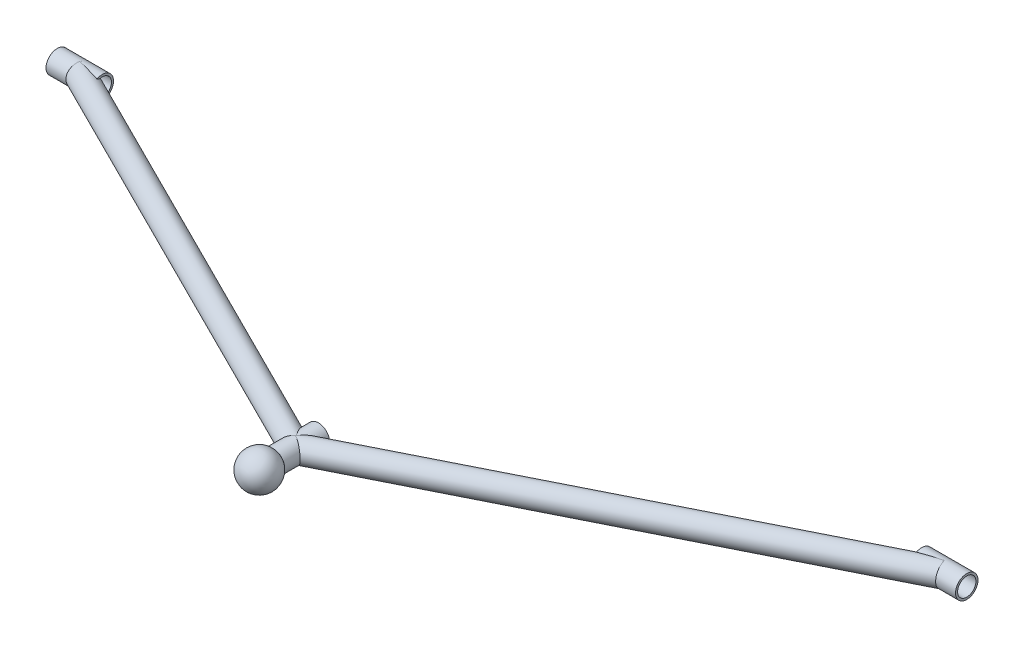
ISO-10303-21;
HEADER;
FILE_DESCRIPTION(('STEP AP214'),'2;1');
FILE_NAME('part.step','',(''),(''),'','','');
FILE_SCHEMA(('AUTOMOTIVE_DESIGN { 1 0 10303 214 1 1 1 1 }'));
ENDSEC;
DATA;
#1=APPLICATION_CONTEXT('core data for automotive mechanical design processes');
#2=APPLICATION_PROTOCOL_DEFINITION('international standard','automotive_design',2000,#1);
#3=PRODUCT_CONTEXT('',#1,'mechanical');
#4=PRODUCT('Part','Part','',(#3));
#5=PRODUCT_RELATED_PRODUCT_CATEGORY('part','',(#4));
#6=PRODUCT_DEFINITION_FORMATION('','',#4);
#7=PRODUCT_DEFINITION_CONTEXT('part definition',#1,'design');
#8=PRODUCT_DEFINITION('design','',#6,#7);
#9=PRODUCT_DEFINITION_SHAPE('','',#8);
#10=(LENGTH_UNIT() NAMED_UNIT(*) SI_UNIT(.MILLI.,.METRE.));
#11=(NAMED_UNIT(*) PLANE_ANGLE_UNIT() SI_UNIT($,.RADIAN.));
#12=(NAMED_UNIT(*) SI_UNIT($,.STERADIAN.) SOLID_ANGLE_UNIT());
#13=UNCERTAINTY_MEASURE_WITH_UNIT(LENGTH_MEASURE(1.E-05),#10,'distance_accuracy_value','');
#14=(GEOMETRIC_REPRESENTATION_CONTEXT(3) GLOBAL_UNCERTAINTY_ASSIGNED_CONTEXT((#13)) GLOBAL_UNIT_ASSIGNED_CONTEXT((#10,
#11,#12)) REPRESENTATION_CONTEXT('',''));
#15=CARTESIAN_POINT('',(0.,0.,0.));
#16=DIRECTION('',(0.,0.,1.));
#17=DIRECTION('',(1.,0.,0.));
#18=AXIS2_PLACEMENT_3D('',#15,#16,#17);
#19=CARTESIAN_POINT('',(0.,0.,178.188934322457));
#20=DIRECTION('',(0.,0.,-1.));
#21=DIRECTION('',(0.,-1.,0.));
#22=AXIS2_PLACEMENT_3D('',#19,#20,#21);
#23=SPHERICAL_SURFACE('',#22,12.7);
#24=CARTESIAN_POINT('',(0.,0.,165.488934322457));
#25=VERTEX_POINT('',#24);
#26=VERTEX_LOOP('',#25);
#27=FACE_BOUND('',#26,.T.);
#28=ADVANCED_FACE('F54',(#27),#23,.T.);
#29=CLOSED_SHELL('',(#28));
#30=MANIFOLD_SOLID_BREP('B2',#29);
#31=CARTESIAN_POINT('',(288.925,0.,0.));
#32=DIRECTION('',(1.,0.,0.));
#33=DIRECTION('',(0.,0.,-1.));
#34=AXIS2_PLACEMENT_3D('',#31,#32,#33);
#35=CYLINDRICAL_SURFACE('',#34,6.4643);
#36=CARTESIAN_POINT('',(288.925,0.,0.));
#37=DIRECTION('',(-1.,0.,0.));
#38=DIRECTION('',(0.,0.,1.));
#39=AXIS2_PLACEMENT_3D('',#36,#37,#38);
#40=CIRCLE('',#39,6.4643);
#41=CARTESIAN_POINT('',(288.925,0.,6.46429999999992));
#42=VERTEX_POINT('',#41);
#43=EDGE_CURVE('E82',#42,#42,#40,.T.);
#44=ORIENTED_EDGE('',*,*,#43,.T.);
#45=EDGE_LOOP('',(#44));
#46=FACE_BOUND('',#45,.T.);
#47=CARTESIAN_POINT('',(320.675,0.,0.));
#48=DIRECTION('',(-1.,0.,0.));
#49=DIRECTION('',(0.,0.,1.));
#50=AXIS2_PLACEMENT_3D('',#47,#48,#49);
#51=CIRCLE('',#50,6.4643);
#52=CARTESIAN_POINT('',(320.675,0.,6.46429999999992));
#53=VERTEX_POINT('',#52);
#54=EDGE_CURVE('E88',#53,#53,#51,.T.);
#55=ORIENTED_EDGE('',*,*,#54,.F.);
#56=EDGE_LOOP('',(#55));
#57=FACE_BOUND('',#56,.T.);
#58=ADVANCED_FACE('F75',(#46,#57),#35,.F.);
#59=CARTESIAN_POINT('',(288.925,0.,0.));
#60=DIRECTION('',(1.,0.,0.));
#61=DIRECTION('',(0.,0.,-1.));
#62=AXIS2_PLACEMENT_3D('',#59,#60,#61);
#63=CYLINDRICAL_SURFACE('',#62,7.9375);
#64=CARTESIAN_POINT('',(288.925,0.,0.));
#65=DIRECTION('',(-1.,0.,0.));
#66=DIRECTION('',(0.,0.,1.));
#67=AXIS2_PLACEMENT_3D('',#64,#65,#66);
#68=CIRCLE('',#67,7.9375);
#69=CARTESIAN_POINT('',(288.925,0.,7.93749999999992));
#70=VERTEX_POINT('',#69);
#71=EDGE_CURVE('E53',#70,#70,#68,.T.);
#72=ORIENTED_EDGE('',*,*,#71,.F.);
#73=EDGE_LOOP('',(#72));
#74=FACE_BOUND('',#73,.T.);
#75=CARTESIAN_POINT('',(320.675,0.,0.));
#76=DIRECTION('',(-1.,0.,0.));
#77=DIRECTION('',(0.,0.,1.));
#78=AXIS2_PLACEMENT_3D('',#75,#76,#77);
#79=CIRCLE('',#78,7.9375);
#80=CARTESIAN_POINT('',(320.675,0.,7.93749999999993));
#81=VERTEX_POINT('',#80);
#82=EDGE_CURVE('E78',#81,#81,#79,.T.);
#83=ORIENTED_EDGE('',*,*,#82,.T.);
#84=EDGE_LOOP('',(#83));
#85=FACE_BOUND('',#84,.T.);
#86=ADVANCED_FACE('F95',(#74,#85),#63,.T.);
#87=CARTESIAN_POINT('',(288.925,0.,0.));
#88=DIRECTION('',(-1.,0.,0.));
#89=DIRECTION('',(0.,0.,1.));
#90=AXIS2_PLACEMENT_3D('',#87,#88,#89);
#91=PLANE('',#90);
#92=ORIENTED_EDGE('',*,*,#43,.F.);
#93=EDGE_LOOP('',(#92));
#94=FACE_BOUND('',#93,.T.);
#95=ORIENTED_EDGE('',*,*,#71,.T.);
#96=EDGE_LOOP('',(#95));
#97=FACE_BOUND('',#96,.T.);
#98=ADVANCED_FACE('F99',(#94,#97),#91,.T.);
#99=CARTESIAN_POINT('',(320.675,0.,0.));
#100=DIRECTION('',(-1.,0.,0.));
#101=DIRECTION('',(0.,0.,1.));
#102=AXIS2_PLACEMENT_3D('',#99,#100,#101);
#103=PLANE('',#102);
#104=ORIENTED_EDGE('',*,*,#54,.T.);
#105=EDGE_LOOP('',(#104));
#106=FACE_BOUND('',#105,.T.);
#107=ORIENTED_EDGE('',*,*,#82,.F.);
#108=EDGE_LOOP('',(#107));
#109=FACE_BOUND('',#108,.T.);
#110=ADVANCED_FACE('F97',(#106,#109),#103,.F.);
#111=CLOSED_SHELL('',(#58,#86,#98,#110));
#112=MANIFOLD_SOLID_BREP('B7',#111);
#113=CARTESIAN_POINT('',(-320.675,0.,0.));
#114=DIRECTION('',(1.,0.,0.));
#115=DIRECTION('',(0.,0.,-1.));
#116=AXIS2_PLACEMENT_3D('',#113,#114,#115);
#117=CYLINDRICAL_SURFACE('',#116,6.4643);
#118=CARTESIAN_POINT('',(-320.675,0.,0.));
#119=DIRECTION('',(-1.,0.,0.));
#120=DIRECTION('',(0.,0.,1.));
#121=AXIS2_PLACEMENT_3D('',#118,#119,#120);
#122=CIRCLE('',#121,6.4643);
#123=CARTESIAN_POINT('',(-320.675,0.,6.4643));
#124=VERTEX_POINT('',#123);
#125=EDGE_CURVE('E160',#124,#124,#122,.T.);
#126=ORIENTED_EDGE('',*,*,#125,.T.);
#127=EDGE_LOOP('',(#126));
#128=FACE_BOUND('',#127,.T.);
#129=CARTESIAN_POINT('',(-288.925,0.,0.));
#130=DIRECTION('',(-1.,0.,0.));
#131=DIRECTION('',(0.,0.,1.));
#132=AXIS2_PLACEMENT_3D('',#129,#130,#131);
#133=CIRCLE('',#132,6.4643);
#134=CARTESIAN_POINT('',(-288.925,0.,6.46429999999999));
#135=VERTEX_POINT('',#134);
#136=EDGE_CURVE('E166',#135,#135,#133,.T.);
#137=ORIENTED_EDGE('',*,*,#136,.F.);
#138=EDGE_LOOP('',(#137));
#139=FACE_BOUND('',#138,.T.);
#140=ADVANCED_FACE('F153',(#128,#139),#117,.F.);
#141=CARTESIAN_POINT('',(-320.675,0.,0.));
#142=DIRECTION('',(1.,0.,0.));
#143=DIRECTION('',(0.,0.,-1.));
#144=AXIS2_PLACEMENT_3D('',#141,#142,#143);
#145=CYLINDRICAL_SURFACE('',#144,7.9375);
#146=CARTESIAN_POINT('',(-320.675,0.,0.));
#147=DIRECTION('',(-1.,0.,0.));
#148=DIRECTION('',(0.,0.,1.));
#149=AXIS2_PLACEMENT_3D('',#146,#147,#148);
#150=CIRCLE('',#149,7.9375);
#151=CARTESIAN_POINT('',(-320.675,0.,7.9375));
#152=VERTEX_POINT('',#151);
#153=EDGE_CURVE('E74',#152,#152,#150,.T.);
#154=ORIENTED_EDGE('',*,*,#153,.F.);
#155=EDGE_LOOP('',(#154));
#156=FACE_BOUND('',#155,.T.);
#157=CARTESIAN_POINT('',(-288.925,0.,0.));
#158=DIRECTION('',(-1.,0.,0.));
#159=DIRECTION('',(0.,0.,1.));
#160=AXIS2_PLACEMENT_3D('',#157,#158,#159);
#161=CIRCLE('',#160,7.9375);
#162=CARTESIAN_POINT('',(-288.925,0.,7.93749999999999));
#163=VERTEX_POINT('',#162);
#164=EDGE_CURVE('E156',#163,#163,#161,.T.);
#165=ORIENTED_EDGE('',*,*,#164,.T.);
#166=EDGE_LOOP('',(#165));
#167=FACE_BOUND('',#166,.T.);
#168=ADVANCED_FACE('F173',(#156,#167),#145,.T.);
#169=CARTESIAN_POINT('',(-320.675,0.,0.));
#170=DIRECTION('',(-1.,0.,0.));
#171=DIRECTION('',(0.,0.,1.));
#172=AXIS2_PLACEMENT_3D('',#169,#170,#171);
#173=PLANE('',#172);
#174=ORIENTED_EDGE('',*,*,#125,.F.);
#175=EDGE_LOOP('',(#174));
#176=FACE_BOUND('',#175,.T.);
#177=ORIENTED_EDGE('',*,*,#153,.T.);
#178=EDGE_LOOP('',(#177));
#179=FACE_BOUND('',#178,.T.);
#180=ADVANCED_FACE('F177',(#176,#179),#173,.T.);
#181=CARTESIAN_POINT('',(-288.925,0.,0.));
#182=DIRECTION('',(-1.,0.,0.));
#183=DIRECTION('',(0.,0.,1.));
#184=AXIS2_PLACEMENT_3D('',#181,#182,#183);
#185=PLANE('',#184);
#186=ORIENTED_EDGE('',*,*,#136,.T.);
#187=EDGE_LOOP('',(#186));
#188=FACE_BOUND('',#187,.T.);
#189=ORIENTED_EDGE('',*,*,#164,.F.);
#190=EDGE_LOOP('',(#189));
#191=FACE_BOUND('',#190,.T.);
#192=ADVANCED_FACE('F175',(#188,#191),#185,.F.);
#193=CLOSED_SHELL('',(#140,#168,#180,#192));
#194=MANIFOLD_SOLID_BREP('B48',#193);
#195=CARTESIAN_POINT('',(0.,0.,168.275));
#196=DIRECTION('',(0.,0.,-1.));
#197=DIRECTION('',(-1.,0.,0.));
#198=AXIS2_PLACEMENT_3D('',#195,#196,#197);
#199=CYLINDRICAL_SURFACE('',#198,6.4643);
#200=CARTESIAN_POINT('',(0.,0.,168.275));
#201=DIRECTION('',(0.,0.,1.));
#202=DIRECTION('',(1.,0.,0.));
#203=AXIS2_PLACEMENT_3D('',#200,#201,#202);
#204=CIRCLE('',#203,6.4643);
#205=CARTESIAN_POINT('',(6.46429999999999,0.,168.275));
#206=VERTEX_POINT('',#205);
#207=EDGE_CURVE('E238',#206,#206,#204,.T.);
#208=ORIENTED_EDGE('',*,*,#207,.T.);
#209=EDGE_LOOP('',(#208));
#210=FACE_BOUND('',#209,.T.);
#211=CARTESIAN_POINT('',(0.,0.,136.525));
#212=DIRECTION('',(0.,0.,1.));
#213=DIRECTION('',(1.,0.,0.));
#214=AXIS2_PLACEMENT_3D('',#211,#212,#213);
#215=CIRCLE('',#214,6.4643);
#216=CARTESIAN_POINT('',(6.46429999999998,0.,136.525));
#217=VERTEX_POINT('',#216);
#218=EDGE_CURVE('E244',#217,#217,#215,.T.);
#219=ORIENTED_EDGE('',*,*,#218,.F.);
#220=EDGE_LOOP('',(#219));
#221=FACE_BOUND('',#220,.T.);
#222=ADVANCED_FACE('F231',(#210,#221),#199,.F.);
#223=CARTESIAN_POINT('',(0.,0.,168.275));
#224=DIRECTION('',(0.,0.,-1.));
#225=DIRECTION('',(-1.,0.,0.));
#226=AXIS2_PLACEMENT_3D('',#223,#224,#225);
#227=CYLINDRICAL_SURFACE('',#226,7.9375);
#228=CARTESIAN_POINT('',(0.,0.,168.275));
#229=DIRECTION('',(0.,0.,1.));
#230=DIRECTION('',(1.,0.,0.));
#231=AXIS2_PLACEMENT_3D('',#228,#229,#230);
#232=CIRCLE('',#231,7.9375);
#233=CARTESIAN_POINT('',(7.93749999999999,0.,168.275));
#234=VERTEX_POINT('',#233);
#235=EDGE_CURVE('E152',#234,#234,#232,.T.);
#236=ORIENTED_EDGE('',*,*,#235,.F.);
#237=EDGE_LOOP('',(#236));
#238=FACE_BOUND('',#237,.T.);
#239=CARTESIAN_POINT('',(0.,0.,136.525));
#240=DIRECTION('',(0.,0.,1.));
#241=DIRECTION('',(1.,0.,0.));
#242=AXIS2_PLACEMENT_3D('',#239,#240,#241);
#243=CIRCLE('',#242,7.9375);
#244=CARTESIAN_POINT('',(7.93749999999998,0.,136.525));
#245=VERTEX_POINT('',#244);
#246=EDGE_CURVE('E234',#245,#245,#243,.T.);
#247=ORIENTED_EDGE('',*,*,#246,.T.);
#248=EDGE_LOOP('',(#247));
#249=FACE_BOUND('',#248,.T.);
#250=ADVANCED_FACE('F251',(#238,#249),#227,.T.);
#251=CARTESIAN_POINT('',(0.,0.,168.275));
#252=DIRECTION('',(0.,0.,1.));
#253=DIRECTION('',(1.,0.,0.));
#254=AXIS2_PLACEMENT_3D('',#251,#252,#253);
#255=PLANE('',#254);
#256=ORIENTED_EDGE('',*,*,#207,.F.);
#257=EDGE_LOOP('',(#256));
#258=FACE_BOUND('',#257,.T.);
#259=ORIENTED_EDGE('',*,*,#235,.T.);
#260=EDGE_LOOP('',(#259));
#261=FACE_BOUND('',#260,.T.);
#262=ADVANCED_FACE('F255',(#258,#261),#255,.T.);
#263=CARTESIAN_POINT('',(0.,0.,136.525));
#264=DIRECTION('',(0.,0.,1.));
#265=DIRECTION('',(1.,0.,0.));
#266=AXIS2_PLACEMENT_3D('',#263,#264,#265);
#267=PLANE('',#266);
#268=ORIENTED_EDGE('',*,*,#218,.T.);
#269=EDGE_LOOP('',(#268));
#270=FACE_BOUND('',#269,.T.);
#271=ORIENTED_EDGE('',*,*,#246,.F.);
#272=EDGE_LOOP('',(#271));
#273=FACE_BOUND('',#272,.T.);
#274=ADVANCED_FACE('F253',(#270,#273),#267,.F.);
#275=CLOSED_SHELL('',(#222,#250,#262,#274));
#276=MANIFOLD_SOLID_BREP('B69',#275);
#277=CARTESIAN_POINT('',(6.66133814775094E-13,1.79187964790969E-12,152.399999999999));
#278=DIRECTION('',(-0.89442719099992,0.,-0.44721359549995));
#279=DIRECTION('',(-0.44721359549995,0.,0.89442719099992));
#280=AXIS2_PLACEMENT_3D('',#277,#278,#279);
#281=CYLINDRICAL_SURFACE('',#280,6.4643);
#282=CARTESIAN_POINT('',(-304.800000000001,-1.78133900447794E-12,1.40165656858926E-12));
#283=DIRECTION('',(0.89442719099992,0.,0.44721359549995));
#284=DIRECTION('',(0.44721359549995,0.,-0.89442719099992));
#285=AXIS2_PLACEMENT_3D('',#282,#283,#284);
#286=CIRCLE('',#285,6.4643);
#287=CARTESIAN_POINT('',(-301.909077154611,-1.78169784521284E-12,-5.78184569077938));
#288=VERTEX_POINT('',#287);
#289=EDGE_CURVE('E317',#288,#288,#286,.T.);
#290=ORIENTED_EDGE('',*,*,#289,.F.);
#291=EDGE_LOOP('',(#290));
#292=FACE_BOUND('',#291,.T.);
#293=CARTESIAN_POINT('',(6.93889390390723E-13,1.79133754682345E-12,152.399999999999));
#294=DIRECTION('',(1.,0.,0.));
#295=DIRECTION('',(0.,0.,-1.));
#296=AXIS2_PLACEMENT_3D('',#293,#294,#295);
#297=ELLIPSE('',#296,7.22730711347594,6.4643);
#298=CARTESIAN_POINT('',(6.25886644970754E-13,1.75763707121709E-12,145.172692886523));
#299=VERTEX_POINT('',#298);
#300=EDGE_CURVE('E312',#299,#299,#297,.T.);
#301=ORIENTED_EDGE('',*,*,#300,.T.);
#302=EDGE_LOOP('',(#301));
#303=FACE_BOUND('',#302,.T.);
#304=ADVANCED_FACE('F308',(#292,#303),#281,.F.);
#305=CARTESIAN_POINT('',(6.66133814775094E-13,1.79187964790969E-12,152.399999999999));
#306=DIRECTION('',(-0.89442719099992,0.,-0.44721359549995));
#307=DIRECTION('',(-0.44721359549995,0.,0.89442719099992));
#308=AXIS2_PLACEMENT_3D('',#305,#306,#307);
#309=CYLINDRICAL_SURFACE('',#308,7.93750000000001);
#310=CARTESIAN_POINT('',(-304.800000000001,-1.78133900447794E-12,1.40165656858926E-12));
#311=DIRECTION('',(0.89442719099992,0.,0.44721359549995));
#312=DIRECTION('',(0.44721359549995,0.,-0.89442719099992));
#313=AXIS2_PLACEMENT_3D('',#310,#311,#312);
#314=CIRCLE('',#313,7.93750000000001);
#315=CARTESIAN_POINT('',(-301.25024208572,-1.78177962424084E-12,-7.09951582856047));
#316=VERTEX_POINT('',#315);
#317=EDGE_CURVE('E322',#316,#316,#314,.T.);
#318=ORIENTED_EDGE('',*,*,#317,.T.);
#319=EDGE_LOOP('',(#318));
#320=FACE_BOUND('',#319,.T.);
#321=CARTESIAN_POINT('',(6.93889390390723E-13,1.79133754682345E-12,152.399999999999));
#322=DIRECTION('',(1.,0.,0.));
#323=DIRECTION('',(0.,0.,-1.));
#324=AXIS2_PLACEMENT_3D('',#321,#322,#323);
#325=ELLIPSE('',#324,8.87439478570229,7.93750000000001);
#326=CARTESIAN_POINT('',(6.10388966250289E-13,1.74995680565651E-12,143.525605214296));
#327=VERTEX_POINT('',#326);
#328=EDGE_CURVE('E230',#327,#327,#325,.T.);
#329=ORIENTED_EDGE('',*,*,#328,.F.);
#330=EDGE_LOOP('',(#329));
#331=FACE_BOUND('',#330,.T.);
#332=ADVANCED_FACE('F339',(#320,#331),#309,.T.);
#333=CARTESIAN_POINT('',(-304.800000000001,-1.78133900447794E-12,1.40165656858926E-12));
#334=DIRECTION('',(0.89442719099992,0.,0.44721359549995));
#335=DIRECTION('',(0.44721359549995,0.,-0.89442719099992));
#336=AXIS2_PLACEMENT_3D('',#333,#334,#335);
#337=PLANE('',#336);
#338=ORIENTED_EDGE('',*,*,#289,.T.);
#339=EDGE_LOOP('',(#338));
#340=FACE_BOUND('',#339,.T.);
#341=ORIENTED_EDGE('',*,*,#317,.F.);
#342=EDGE_LOOP('',(#341));
#343=FACE_BOUND('',#342,.T.);
#344=ADVANCED_FACE('F335',(#340,#343),#337,.F.);
#345=CARTESIAN_POINT('',(7.49400541621981E-13,1.79297740260934E-12,152.399999999999));
#346=DIRECTION('',(1.,0.,0.));
#347=DIRECTION('',(0.,0.,-1.));
#348=AXIS2_PLACEMENT_3D('',#345,#346,#347);
#349=PLANE('',#348);
#350=ORIENTED_EDGE('',*,*,#300,.F.);
#351=EDGE_LOOP('',(#350));
#352=FACE_BOUND('',#351,.T.);
#353=ORIENTED_EDGE('',*,*,#328,.T.);
#354=EDGE_LOOP('',(#353));
#355=FACE_BOUND('',#354,.T.);
#356=ADVANCED_FACE('F310',(#352,#355),#349,.T.);
#357=CLOSED_SHELL('',(#304,#332,#344,#356));
#358=MANIFOLD_SOLID_BREP('B147',#357);
#359=CARTESIAN_POINT('',(304.8,0.,0.));
#360=DIRECTION('',(-0.894427190999916,0.,0.447213595499958));
#361=DIRECTION('',(0.447213595499958,0.,0.894427190999916));
#362=AXIS2_PLACEMENT_3D('',#359,#360,#361);
#363=CYLINDRICAL_SURFACE('',#362,6.4643);
#364=CARTESIAN_POINT('',(304.8,0.,0.));
#365=DIRECTION('',(0.894427190999916,0.,-0.447213595499958));
#366=DIRECTION('',(-0.447213595499958,0.,-0.894427190999916));
#367=AXIS2_PLACEMENT_3D('',#364,#365,#366);
#368=CIRCLE('',#367,6.4643);
#369=CARTESIAN_POINT('',(301.90907715461,0.,-5.78184569078084));
#370=VERTEX_POINT('',#369);
#371=EDGE_CURVE('E409',#370,#370,#368,.T.);
#372=ORIENTED_EDGE('',*,*,#371,.T.);
#373=EDGE_LOOP('',(#372));
#374=FACE_BOUND('',#373,.T.);
#375=CARTESIAN_POINT('',(0.,0.,152.4));
#376=DIRECTION('',(-1.,0.,0.));
#377=DIRECTION('',(0.,0.,1.));
#378=AXIS2_PLACEMENT_3D('',#375,#376,#377);
#379=ELLIPSE('',#378,7.22730711347594,6.4643);
#380=CARTESIAN_POINT('',(0.,0.,159.627307113476));
#381=VERTEX_POINT('',#380);
#382=EDGE_CURVE('E399',#381,#381,#379,.T.);
#383=ORIENTED_EDGE('',*,*,#382,.T.);
#384=EDGE_LOOP('',(#383));
#385=FACE_BOUND('',#384,.T.);
#386=ADVANCED_FACE('F395',(#374,#385),#363,.F.);
#387=CARTESIAN_POINT('',(304.8,0.,0.));
#388=DIRECTION('',(-0.894427190999916,0.,0.447213595499958));
#389=DIRECTION('',(0.447213595499958,0.,0.894427190999916));
#390=AXIS2_PLACEMENT_3D('',#387,#388,#389);
#391=CYLINDRICAL_SURFACE('',#390,7.93750000000001);
#392=CARTESIAN_POINT('',(304.8,0.,0.));
#393=DIRECTION('',(0.894427190999916,0.,-0.447213595499958));
#394=DIRECTION('',(-0.447213595499958,0.,-0.894427190999916));
#395=AXIS2_PLACEMENT_3D('',#392,#393,#394);
#396=CIRCLE('',#395,7.93750000000001);
#397=CARTESIAN_POINT('',(301.250242085719,0.,-7.09951582856192));
#398=VERTEX_POINT('',#397);
#399=EDGE_CURVE('E403',#398,#398,#396,.T.);
#400=ORIENTED_EDGE('',*,*,#399,.F.);
#401=EDGE_LOOP('',(#400));
#402=FACE_BOUND('',#401,.T.);
#403=CARTESIAN_POINT('',(0.,0.,152.4));
#404=DIRECTION('',(-1.,0.,0.));
#405=DIRECTION('',(0.,0.,1.));
#406=AXIS2_PLACEMENT_3D('',#403,#404,#405);
#407=ELLIPSE('',#406,8.87439478570229,7.93750000000001);
#408=CARTESIAN_POINT('',(0.,0.,161.274394785702));
#409=VERTEX_POINT('',#408);
#410=EDGE_CURVE('E307',#409,#409,#407,.T.);
#411=ORIENTED_EDGE('',*,*,#410,.F.);
#412=EDGE_LOOP('',(#411));
#413=FACE_BOUND('',#412,.T.);
#414=ADVANCED_FACE('F422',(#402,#413),#391,.T.);
#415=CARTESIAN_POINT('',(304.8,0.,0.));
#416=DIRECTION('',(0.894427190999916,0.,-0.447213595499958));
#417=DIRECTION('',(-0.447213595499958,0.,-0.894427190999916));
#418=AXIS2_PLACEMENT_3D('',#415,#416,#417);
#419=PLANE('',#418);
#420=ORIENTED_EDGE('',*,*,#371,.F.);
#421=EDGE_LOOP('',(#420));
#422=FACE_BOUND('',#421,.T.);
#423=ORIENTED_EDGE('',*,*,#399,.T.);
#424=EDGE_LOOP('',(#423));
#425=FACE_BOUND('',#424,.T.);
#426=ADVANCED_FACE('F418',(#422,#425),#419,.T.);
#427=CARTESIAN_POINT('',(0.,0.,152.4));
#428=DIRECTION('',(-1.,0.,0.));
#429=DIRECTION('',(0.,0.,1.));
#430=AXIS2_PLACEMENT_3D('',#427,#428,#429);
#431=PLANE('',#430);
#432=ORIENTED_EDGE('',*,*,#382,.F.);
#433=EDGE_LOOP('',(#432));
#434=FACE_BOUND('',#433,.T.);
#435=ORIENTED_EDGE('',*,*,#410,.T.);
#436=EDGE_LOOP('',(#435));
#437=FACE_BOUND('',#436,.T.);
#438=ADVANCED_FACE('F397',(#434,#437),#431,.T.);
#439=CLOSED_SHELL('',(#386,#414,#426,#438));
#440=MANIFOLD_SOLID_BREP('B225',#439);
#441=ADVANCED_BREP_SHAPE_REPRESENTATION('',(#18,#30,#112,#194,#276,#358,#440),#14);
#442=SHAPE_DEFINITION_REPRESENTATION(#9,#441);
ENDSEC;
END-ISO-10303-21;
